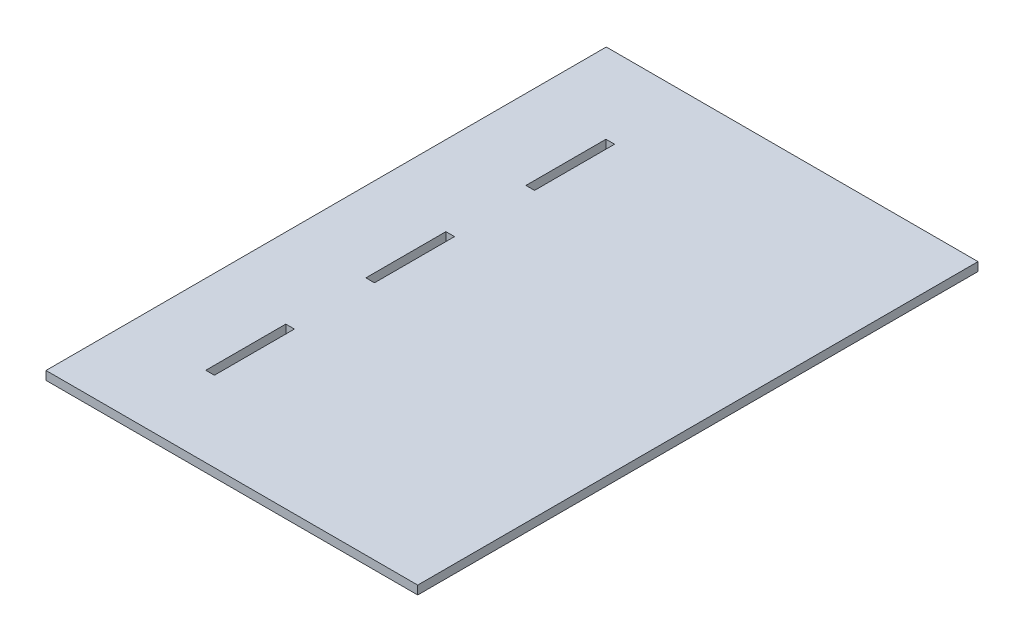
ISO-10303-21;
HEADER;
FILE_DESCRIPTION(('STEP AP214'),'2;1');
FILE_NAME('part.step','',(''),(''),'','','');
FILE_SCHEMA(('AUTOMOTIVE_DESIGN { 1 0 10303 214 1 1 1 1 }'));
ENDSEC;
DATA;
#1=APPLICATION_CONTEXT('core data for automotive mechanical design processes');
#2=APPLICATION_PROTOCOL_DEFINITION('international standard','automotive_design',2000,#1);
#3=PRODUCT_CONTEXT('',#1,'mechanical');
#4=PRODUCT('Part','Part','',(#3));
#5=PRODUCT_RELATED_PRODUCT_CATEGORY('part','',(#4));
#6=PRODUCT_DEFINITION_FORMATION('','',#4);
#7=PRODUCT_DEFINITION_CONTEXT('part definition',#1,'design');
#8=PRODUCT_DEFINITION('design','',#6,#7);
#9=PRODUCT_DEFINITION_SHAPE('','',#8);
#10=(LENGTH_UNIT() NAMED_UNIT(*) SI_UNIT(.MILLI.,.METRE.));
#11=(NAMED_UNIT(*) PLANE_ANGLE_UNIT() SI_UNIT($,.RADIAN.));
#12=(NAMED_UNIT(*) SI_UNIT($,.STERADIAN.) SOLID_ANGLE_UNIT());
#13=UNCERTAINTY_MEASURE_WITH_UNIT(LENGTH_MEASURE(1.E-05),#10,'distance_accuracy_value','');
#14=(GEOMETRIC_REPRESENTATION_CONTEXT(3) GLOBAL_UNCERTAINTY_ASSIGNED_CONTEXT((#13)) GLOBAL_UNIT_ASSIGNED_CONTEXT((#10,
#11,#12)) REPRESENTATION_CONTEXT('',''));
#15=CARTESIAN_POINT('',(0.,0.,0.));
#16=DIRECTION('',(0.,0.,1.));
#17=DIRECTION('',(1.,0.,0.));
#18=AXIS2_PLACEMENT_3D('',#15,#16,#17);
#19=CARTESIAN_POINT('',(93.9799999999998,10.16,0.));
#20=DIRECTION('',(1.,0.,0.));
#21=DIRECTION('',(0.,0.,-1.));
#22=AXIS2_PLACEMENT_3D('',#19,#20,#21);
#23=PLANE('',#22);
#24=DIRECTION('',(0.,0.,1.));
#25=VECTOR('',#24,1.);
#26=CARTESIAN_POINT('',(93.9799999999998,0.,0.));
#27=LINE('',#26,#25);
#28=CARTESIAN_POINT('',(93.9799999999998,0.,94.3428571428572));
#29=VERTEX_POINT('',#28);
#30=CARTESIAN_POINT('',(93.9799999999998,0.,188.685714285714));
#31=VERTEX_POINT('',#30);
#32=EDGE_CURVE('E250',#29,#31,#27,.T.);
#33=ORIENTED_EDGE('',*,*,#32,.F.);
#34=DIRECTION('',(0.,-1.,0.));
#35=VECTOR('',#34,1.);
#36=CARTESIAN_POINT('',(93.9799999999998,10.16,94.3428571428572));
#37=LINE('',#36,#35);
#38=CARTESIAN_POINT('',(93.9799999999998,10.16,94.3428571428572));
#39=VERTEX_POINT('',#38);
#40=EDGE_CURVE('E11',#39,#29,#37,.T.);
#41=ORIENTED_EDGE('',*,*,#40,.F.);
#42=DIRECTION('',(0.,0.,1.));
#43=VECTOR('',#42,1.);
#44=CARTESIAN_POINT('',(93.9799999999998,10.16,0.));
#45=LINE('',#44,#43);
#46=CARTESIAN_POINT('',(93.9799999999998,10.16,188.685714285714));
#47=VERTEX_POINT('',#46);
#48=EDGE_CURVE('E173',#39,#47,#45,.T.);
#49=ORIENTED_EDGE('',*,*,#48,.T.);
#50=DIRECTION('',(0.,-1.,0.));
#51=VECTOR('',#50,1.);
#52=CARTESIAN_POINT('',(93.9799999999998,10.16,188.685714285714));
#53=LINE('',#52,#51);
#54=EDGE_CURVE('E112',#47,#31,#53,.T.);
#55=ORIENTED_EDGE('',*,*,#54,.T.);
#56=EDGE_LOOP('',(#33,#41,#49,#55));
#57=FACE_BOUND('',#56,.T.);
#58=ADVANCED_FACE('F35',(#57),#23,.T.);
#59=CARTESIAN_POINT('',(0.,10.16,94.3428571428572));
#60=DIRECTION('',(0.,0.,-1.));
#61=DIRECTION('',(-1.,0.,0.));
#62=AXIS2_PLACEMENT_3D('',#59,#60,#61);
#63=PLANE('',#62);
#64=DIRECTION('',(1.,0.,0.));
#65=VECTOR('',#64,1.);
#66=CARTESIAN_POINT('',(0.,0.,94.3428571428572));
#67=LINE('',#66,#65);
#68=CARTESIAN_POINT('',(104.14,0.,94.3428571428572));
#69=VERTEX_POINT('',#68);
#70=EDGE_CURVE('E178',#29,#69,#67,.T.);
#71=ORIENTED_EDGE('',*,*,#70,.T.);
#72=DIRECTION('',(0.,-1.,0.));
#73=VECTOR('',#72,1.);
#74=CARTESIAN_POINT('',(104.14,10.16,94.3428571428572));
#75=LINE('',#74,#73);
#76=CARTESIAN_POINT('',(104.14,10.16,94.3428571428572));
#77=VERTEX_POINT('',#76);
#78=EDGE_CURVE('E45',#77,#69,#75,.T.);
#79=ORIENTED_EDGE('',*,*,#78,.F.);
#80=DIRECTION('',(1.,0.,0.));
#81=VECTOR('',#80,1.);
#82=CARTESIAN_POINT('',(0.,10.16,94.3428571428572));
#83=LINE('',#82,#81);
#84=EDGE_CURVE('E167',#39,#77,#83,.T.);
#85=ORIENTED_EDGE('',*,*,#84,.F.);
#86=ORIENTED_EDGE('',*,*,#40,.T.);
#87=EDGE_LOOP('',(#71,#79,#85,#86));
#88=FACE_BOUND('',#87,.T.);
#89=ADVANCED_FACE('F176',(#88),#63,.F.);
#90=CARTESIAN_POINT('',(104.14,10.16,0.));
#91=DIRECTION('',(1.,0.,0.));
#92=DIRECTION('',(0.,0.,-1.));
#93=AXIS2_PLACEMENT_3D('',#90,#91,#92);
#94=PLANE('',#93);
#95=DIRECTION('',(0.,0.,1.));
#96=VECTOR('',#95,1.);
#97=CARTESIAN_POINT('',(104.14,0.,0.));
#98=LINE('',#97,#96);
#99=CARTESIAN_POINT('',(104.14,0.,188.685714285714));
#100=VERTEX_POINT('',#99);
#101=EDGE_CURVE('E242',#69,#100,#98,.T.);
#102=ORIENTED_EDGE('',*,*,#101,.T.);
#103=DIRECTION('',(0.,-1.,0.));
#104=VECTOR('',#103,1.);
#105=CARTESIAN_POINT('',(104.14,10.16,188.685714285714));
#106=LINE('',#105,#104);
#107=CARTESIAN_POINT('',(104.14,10.16,188.685714285714));
#108=VERTEX_POINT('',#107);
#109=EDGE_CURVE('E166',#108,#100,#106,.T.);
#110=ORIENTED_EDGE('',*,*,#109,.F.);
#111=DIRECTION('',(0.,0.,1.));
#112=VECTOR('',#111,1.);
#113=CARTESIAN_POINT('',(104.14,10.16,0.));
#114=LINE('',#113,#112);
#115=EDGE_CURVE('E160',#77,#108,#114,.T.);
#116=ORIENTED_EDGE('',*,*,#115,.F.);
#117=ORIENTED_EDGE('',*,*,#78,.T.);
#118=EDGE_LOOP('',(#102,#110,#116,#117));
#119=FACE_BOUND('',#118,.T.);
#120=ADVANCED_FACE('F163',(#119),#94,.F.);
#121=CARTESIAN_POINT('',(0.,10.16,283.028571428571));
#122=DIRECTION('',(0.,0.,-1.));
#123=DIRECTION('',(-1.,0.,0.));
#124=AXIS2_PLACEMENT_3D('',#121,#122,#123);
#125=PLANE('',#124);
#126=DIRECTION('',(1.,0.,0.));
#127=VECTOR('',#126,1.);
#128=CARTESIAN_POINT('',(0.,0.,283.028571428571));
#129=LINE('',#128,#127);
#130=CARTESIAN_POINT('',(93.9799999999998,0.,283.028571428571));
#131=VERTEX_POINT('',#130);
#132=CARTESIAN_POINT('',(104.14,0.,283.028571428571));
#133=VERTEX_POINT('',#132);
#134=EDGE_CURVE('E249',#131,#133,#129,.T.);
#135=ORIENTED_EDGE('',*,*,#134,.T.);
#136=DIRECTION('',(0.,-1.,0.));
#137=VECTOR('',#136,1.);
#138=CARTESIAN_POINT('',(104.14,10.16,283.028571428571));
#139=LINE('',#138,#137);
#140=CARTESIAN_POINT('',(104.14,10.16,283.028571428571));
#141=VERTEX_POINT('',#140);
#142=EDGE_CURVE('E191',#141,#133,#139,.T.);
#143=ORIENTED_EDGE('',*,*,#142,.F.);
#144=DIRECTION('',(1.,0.,0.));
#145=VECTOR('',#144,1.);
#146=CARTESIAN_POINT('',(0.,10.16,283.028571428571));
#147=LINE('',#146,#145);
#148=CARTESIAN_POINT('',(93.9799999999998,10.16,283.028571428571));
#149=VERTEX_POINT('',#148);
#150=EDGE_CURVE('E282',#149,#141,#147,.T.);
#151=ORIENTED_EDGE('',*,*,#150,.F.);
#152=DIRECTION('',(0.,-1.,0.));
#153=VECTOR('',#152,1.);
#154=CARTESIAN_POINT('',(93.9799999999998,10.16,283.028571428571));
#155=LINE('',#154,#153);
#156=EDGE_CURVE('E183',#149,#131,#155,.T.);
#157=ORIENTED_EDGE('',*,*,#156,.T.);
#158=EDGE_LOOP('',(#135,#143,#151,#157));
#159=FACE_BOUND('',#158,.T.);
#160=ADVANCED_FACE('F346',(#159),#125,.F.);
#161=CARTESIAN_POINT('',(104.14,0.,377.371428571429));
#162=VERTEX_POINT('',#161);
#163=EDGE_CURVE('E243',#133,#162,#98,.T.);
#164=ORIENTED_EDGE('',*,*,#163,.T.);
#165=DIRECTION('',(0.,-1.,0.));
#166=VECTOR('',#165,1.);
#167=CARTESIAN_POINT('',(104.14,10.16,377.371428571429));
#168=LINE('',#167,#166);
#169=CARTESIAN_POINT('',(104.14,10.16,377.371428571429));
#170=VERTEX_POINT('',#169);
#171=EDGE_CURVE('E188',#170,#162,#168,.T.);
#172=ORIENTED_EDGE('',*,*,#171,.F.);
#173=EDGE_CURVE('E169',#141,#170,#114,.T.);
#174=ORIENTED_EDGE('',*,*,#173,.F.);
#175=ORIENTED_EDGE('',*,*,#142,.T.);
#176=EDGE_LOOP('',(#164,#172,#174,#175));
#177=FACE_BOUND('',#176,.T.);
#178=ADVANCED_FACE('F262',(#177),#94,.F.);
#179=CARTESIAN_POINT('',(0.,10.16,377.371428571429));
#180=DIRECTION('',(0.,0.,1.));
#181=DIRECTION('',(1.,0.,0.));
#182=AXIS2_PLACEMENT_3D('',#179,#180,#181);
#183=PLANE('',#182);
#184=DIRECTION('',(-1.,0.,0.));
#185=VECTOR('',#184,1.);
#186=CARTESIAN_POINT('',(0.,0.,377.371428571429));
#187=LINE('',#186,#185);
#188=CARTESIAN_POINT('',(93.9799999999999,0.,377.371428571429));
#189=VERTEX_POINT('',#188);
#190=EDGE_CURVE('E254',#162,#189,#187,.T.);
#191=ORIENTED_EDGE('',*,*,#190,.T.);
#192=DIRECTION('',(0.,-1.,0.));
#193=VECTOR('',#192,1.);
#194=CARTESIAN_POINT('',(93.9799999999999,10.16,377.371428571429));
#195=LINE('',#194,#193);
#196=CARTESIAN_POINT('',(93.9799999999999,10.16,377.371428571429));
#197=VERTEX_POINT('',#196);
#198=EDGE_CURVE('E185',#197,#189,#195,.T.);
#199=ORIENTED_EDGE('',*,*,#198,.F.);
#200=DIRECTION('',(-1.,0.,0.));
#201=VECTOR('',#200,1.);
#202=CARTESIAN_POINT('',(0.,10.16,377.371428571429));
#203=LINE('',#202,#201);
#204=EDGE_CURVE('E272',#170,#197,#203,.T.);
#205=ORIENTED_EDGE('',*,*,#204,.F.);
#206=ORIENTED_EDGE('',*,*,#171,.T.);
#207=EDGE_LOOP('',(#191,#199,#205,#206));
#208=FACE_BOUND('',#207,.T.);
#209=ADVANCED_FACE('F269',(#208),#183,.F.);
#210=CARTESIAN_POINT('',(0.,10.16,471.714285714286));
#211=DIRECTION('',(0.,0.,-1.));
#212=DIRECTION('',(-1.,0.,0.));
#213=AXIS2_PLACEMENT_3D('',#210,#211,#212);
#214=PLANE('',#213);
#215=DIRECTION('',(1.,0.,0.));
#216=VECTOR('',#215,1.);
#217=CARTESIAN_POINT('',(0.,0.,471.714285714286));
#218=LINE('',#217,#216);
#219=CARTESIAN_POINT('',(93.9799999999999,0.,471.714285714286));
#220=VERTEX_POINT('',#219);
#221=CARTESIAN_POINT('',(104.14,0.,471.714285714286));
#222=VERTEX_POINT('',#221);
#223=EDGE_CURVE('E236',#220,#222,#218,.T.);
#224=ORIENTED_EDGE('',*,*,#223,.T.);
#225=DIRECTION('',(0.,-1.,0.));
#226=VECTOR('',#225,1.);
#227=CARTESIAN_POINT('',(104.14,10.16,471.714285714286));
#228=LINE('',#227,#226);
#229=CARTESIAN_POINT('',(104.14,10.16,471.714285714286));
#230=VERTEX_POINT('',#229);
#231=EDGE_CURVE('E186',#230,#222,#228,.T.);
#232=ORIENTED_EDGE('',*,*,#231,.F.);
#233=DIRECTION('',(1.,0.,0.));
#234=VECTOR('',#233,1.);
#235=CARTESIAN_POINT('',(0.,10.16,471.714285714286));
#236=LINE('',#235,#234);
#237=CARTESIAN_POINT('',(93.9799999999999,10.16,471.714285714286));
#238=VERTEX_POINT('',#237);
#239=EDGE_CURVE('E290',#238,#230,#236,.T.);
#240=ORIENTED_EDGE('',*,*,#239,.F.);
#241=DIRECTION('',(0.,-1.,0.));
#242=VECTOR('',#241,1.);
#243=CARTESIAN_POINT('',(93.9799999999999,10.16,471.714285714286));
#244=LINE('',#243,#242);
#245=EDGE_CURVE('E194',#238,#220,#244,.T.);
#246=ORIENTED_EDGE('',*,*,#245,.T.);
#247=EDGE_LOOP('',(#224,#232,#240,#246));
#248=FACE_BOUND('',#247,.T.);
#249=ADVANCED_FACE('F342',(#248),#214,.F.);
#250=CARTESIAN_POINT('',(104.14,0.,566.057142857143));
#251=VERTEX_POINT('',#250);
#252=EDGE_CURVE('E239',#222,#251,#98,.T.);
#253=ORIENTED_EDGE('',*,*,#252,.T.);
#254=DIRECTION('',(0.,-1.,0.));
#255=VECTOR('',#254,1.);
#256=CARTESIAN_POINT('',(104.14,10.16,566.057142857143));
#257=LINE('',#256,#255);
#258=CARTESIAN_POINT('',(104.14,10.16,566.057142857143));
#259=VERTEX_POINT('',#258);
#260=EDGE_CURVE('E198',#259,#251,#257,.T.);
#261=ORIENTED_EDGE('',*,*,#260,.F.);
#262=EDGE_CURVE('E170',#230,#259,#114,.T.);
#263=ORIENTED_EDGE('',*,*,#262,.F.);
#264=ORIENTED_EDGE('',*,*,#231,.T.);
#265=EDGE_LOOP('',(#253,#261,#263,#264));
#266=FACE_BOUND('',#265,.T.);
#267=ADVANCED_FACE('F336',(#266),#94,.F.);
#268=CARTESIAN_POINT('',(0.,10.16,566.057142857143));
#269=DIRECTION('',(0.,0.,1.));
#270=DIRECTION('',(1.,0.,0.));
#271=AXIS2_PLACEMENT_3D('',#268,#269,#270);
#272=PLANE('',#271);
#273=DIRECTION('',(-1.,0.,0.));
#274=VECTOR('',#273,1.);
#275=CARTESIAN_POINT('',(0.,0.,566.057142857143));
#276=LINE('',#275,#274);
#277=CARTESIAN_POINT('',(93.9799999999999,0.,566.057142857143));
#278=VERTEX_POINT('',#277);
#279=EDGE_CURVE('E241',#251,#278,#276,.T.);
#280=ORIENTED_EDGE('',*,*,#279,.T.);
#281=DIRECTION('',(0.,-1.,0.));
#282=VECTOR('',#281,1.);
#283=CARTESIAN_POINT('',(93.9799999999999,10.16,566.057142857143));
#284=LINE('',#283,#282);
#285=CARTESIAN_POINT('',(93.9799999999999,10.16,566.057142857143));
#286=VERTEX_POINT('',#285);
#287=EDGE_CURVE('E196',#286,#278,#284,.T.);
#288=ORIENTED_EDGE('',*,*,#287,.F.);
#289=DIRECTION('',(-1.,0.,0.));
#290=VECTOR('',#289,1.);
#291=CARTESIAN_POINT('',(0.,10.16,566.057142857143));
#292=LINE('',#291,#290);
#293=EDGE_CURVE('E283',#259,#286,#292,.T.);
#294=ORIENTED_EDGE('',*,*,#293,.F.);
#295=ORIENTED_EDGE('',*,*,#260,.T.);
#296=EDGE_LOOP('',(#280,#288,#294,#295));
#297=FACE_BOUND('',#296,.T.);
#298=ADVANCED_FACE('F332',(#297),#272,.F.);
#299=CARTESIAN_POINT('',(0.,10.16,660.4));
#300=DIRECTION('',(0.,0.,-1.));
#301=DIRECTION('',(-1.,0.,0.));
#302=AXIS2_PLACEMENT_3D('',#299,#300,#301);
#303=PLANE('',#302);
#304=DIRECTION('',(1.,0.,0.));
#305=VECTOR('',#304,1.);
#306=CARTESIAN_POINT('',(0.,0.,660.4));
#307=LINE('',#306,#305);
#308=CARTESIAN_POINT('',(0.,0.,660.4));
#309=VERTEX_POINT('',#308);
#310=CARTESIAN_POINT('',(438.15,0.,660.4));
#311=VERTEX_POINT('',#310);
#312=EDGE_CURVE('E222',#309,#311,#307,.T.);
#313=ORIENTED_EDGE('',*,*,#312,.T.);
#314=DIRECTION('',(0.,-1.,0.));
#315=VECTOR('',#314,1.);
#316=CARTESIAN_POINT('',(438.15,10.16,660.4));
#317=LINE('',#316,#315);
#318=CARTESIAN_POINT('',(438.15,10.16,660.4));
#319=VERTEX_POINT('',#318);
#320=EDGE_CURVE('E39',#319,#311,#317,.T.);
#321=ORIENTED_EDGE('',*,*,#320,.F.);
#322=DIRECTION('',(1.,0.,0.));
#323=VECTOR('',#322,1.);
#324=CARTESIAN_POINT('',(0.,10.16,660.4));
#325=LINE('',#324,#323);
#326=CARTESIAN_POINT('',(0.,10.16,660.4));
#327=VERTEX_POINT('',#326);
#328=EDGE_CURVE('E120',#327,#319,#325,.T.);
#329=ORIENTED_EDGE('',*,*,#328,.F.);
#330=DIRECTION('',(0.,-1.,0.));
#331=VECTOR('',#330,1.);
#332=CARTESIAN_POINT('',(0.,10.16,660.4));
#333=LINE('',#332,#331);
#334=EDGE_CURVE('E203',#327,#309,#333,.T.);
#335=ORIENTED_EDGE('',*,*,#334,.T.);
#336=EDGE_LOOP('',(#313,#321,#329,#335));
#337=FACE_BOUND('',#336,.T.);
#338=ADVANCED_FACE('F37',(#337),#303,.F.);
#339=CARTESIAN_POINT('',(438.15,10.16,0.));
#340=DIRECTION('',(1.,0.,0.));
#341=DIRECTION('',(0.,0.,-1.));
#342=AXIS2_PLACEMENT_3D('',#339,#340,#341);
#343=PLANE('',#342);
#344=DIRECTION('',(0.,0.,1.));
#345=VECTOR('',#344,1.);
#346=CARTESIAN_POINT('',(438.15,0.,0.));
#347=LINE('',#346,#345);
#348=CARTESIAN_POINT('',(438.15,0.,0.));
#349=VERTEX_POINT('',#348);
#350=EDGE_CURVE('E217',#349,#311,#347,.T.);
#351=ORIENTED_EDGE('',*,*,#350,.F.);
#352=DIRECTION('',(0.,-1.,0.));
#353=VECTOR('',#352,1.);
#354=CARTESIAN_POINT('',(438.15,10.16,0.));
#355=LINE('',#354,#353);
#356=CARTESIAN_POINT('',(438.15,10.16,0.));
#357=VERTEX_POINT('',#356);
#358=EDGE_CURVE('E207',#357,#349,#355,.T.);
#359=ORIENTED_EDGE('',*,*,#358,.F.);
#360=DIRECTION('',(0.,0.,1.));
#361=VECTOR('',#360,1.);
#362=CARTESIAN_POINT('',(438.15,10.16,0.));
#363=LINE('',#362,#361);
#364=EDGE_CURVE('E219',#357,#319,#363,.T.);
#365=ORIENTED_EDGE('',*,*,#364,.T.);
#366=ORIENTED_EDGE('',*,*,#320,.T.);
#367=EDGE_LOOP('',(#351,#359,#365,#366));
#368=FACE_BOUND('',#367,.T.);
#369=ADVANCED_FACE('F215',(#368),#343,.T.);
#370=CARTESIAN_POINT('',(0.,10.16,0.));
#371=DIRECTION('',(0.,0.,-1.));
#372=DIRECTION('',(-1.,0.,0.));
#373=AXIS2_PLACEMENT_3D('',#370,#371,#372);
#374=PLANE('',#373);
#375=DIRECTION('',(1.,0.,0.));
#376=VECTOR('',#375,1.);
#377=CARTESIAN_POINT('',(0.,0.,0.));
#378=LINE('',#377,#376);
#379=CARTESIAN_POINT('',(0.,0.,0.));
#380=VERTEX_POINT('',#379);
#381=EDGE_CURVE('E229',#380,#349,#378,.T.);
#382=ORIENTED_EDGE('',*,*,#381,.F.);
#383=DIRECTION('',(0.,-1.,0.));
#384=VECTOR('',#383,1.);
#385=CARTESIAN_POINT('',(0.,10.16,0.));
#386=LINE('',#385,#384);
#387=CARTESIAN_POINT('',(0.,10.16,0.));
#388=VERTEX_POINT('',#387);
#389=EDGE_CURVE('E206',#388,#380,#386,.T.);
#390=ORIENTED_EDGE('',*,*,#389,.F.);
#391=DIRECTION('',(1.,0.,0.));
#392=VECTOR('',#391,1.);
#393=CARTESIAN_POINT('',(0.,10.16,0.));
#394=LINE('',#393,#392);
#395=EDGE_CURVE('E296',#388,#357,#394,.T.);
#396=ORIENTED_EDGE('',*,*,#395,.T.);
#397=ORIENTED_EDGE('',*,*,#358,.T.);
#398=EDGE_LOOP('',(#382,#390,#396,#397));
#399=FACE_BOUND('',#398,.T.);
#400=ADVANCED_FACE('F299',(#399),#374,.T.);
#401=EDGE_CURVE('E251',#131,#189,#27,.T.);
#402=ORIENTED_EDGE('',*,*,#401,.F.);
#403=ORIENTED_EDGE('',*,*,#156,.F.);
#404=EDGE_CURVE('E275',#149,#197,#45,.T.);
#405=ORIENTED_EDGE('',*,*,#404,.T.);
#406=ORIENTED_EDGE('',*,*,#198,.T.);
#407=EDGE_LOOP('',(#402,#403,#405,#406));
#408=FACE_BOUND('',#407,.T.);
#409=ADVANCED_FACE('F312',(#408),#23,.T.);
#410=EDGE_CURVE('E246',#220,#278,#27,.T.);
#411=ORIENTED_EDGE('',*,*,#410,.F.);
#412=ORIENTED_EDGE('',*,*,#245,.F.);
#413=EDGE_CURVE('E277',#238,#286,#45,.T.);
#414=ORIENTED_EDGE('',*,*,#413,.T.);
#415=ORIENTED_EDGE('',*,*,#287,.T.);
#416=EDGE_LOOP('',(#411,#412,#414,#415));
#417=FACE_BOUND('',#416,.T.);
#418=ADVANCED_FACE('F305',(#417),#23,.T.);
#419=CARTESIAN_POINT('',(0.,10.16,0.));
#420=DIRECTION('',(1.,0.,0.));
#421=DIRECTION('',(0.,0.,-1.));
#422=AXIS2_PLACEMENT_3D('',#419,#420,#421);
#423=PLANE('',#422);
#424=DIRECTION('',(0.,0.,1.));
#425=VECTOR('',#424,1.);
#426=CARTESIAN_POINT('',(0.,0.,0.));
#427=LINE('',#426,#425);
#428=EDGE_CURVE('E231',#380,#309,#427,.T.);
#429=ORIENTED_EDGE('',*,*,#428,.T.);
#430=ORIENTED_EDGE('',*,*,#334,.F.);
#431=DIRECTION('',(0.,0.,1.));
#432=VECTOR('',#431,1.);
#433=CARTESIAN_POINT('',(0.,10.16,0.));
#434=LINE('',#433,#432);
#435=EDGE_CURVE('E294',#388,#327,#434,.T.);
#436=ORIENTED_EDGE('',*,*,#435,.F.);
#437=ORIENTED_EDGE('',*,*,#389,.T.);
#438=EDGE_LOOP('',(#429,#430,#436,#437));
#439=FACE_BOUND('',#438,.T.);
#440=ADVANCED_FACE('F302',(#439),#423,.F.);
#441=CARTESIAN_POINT('',(0.,10.16,188.685714285714));
#442=DIRECTION('',(0.,0.,1.));
#443=DIRECTION('',(1.,0.,0.));
#444=AXIS2_PLACEMENT_3D('',#441,#442,#443);
#445=PLANE('',#444);
#446=DIRECTION('',(-1.,0.,0.));
#447=VECTOR('',#446,1.);
#448=CARTESIAN_POINT('',(0.,0.,188.685714285714));
#449=LINE('',#448,#447);
#450=EDGE_CURVE('E105',#100,#31,#449,.T.);
#451=ORIENTED_EDGE('',*,*,#450,.T.);
#452=ORIENTED_EDGE('',*,*,#54,.F.);
#453=DIRECTION('',(-1.,0.,0.));
#454=VECTOR('',#453,1.);
#455=CARTESIAN_POINT('',(0.,10.16,188.685714285714));
#456=LINE('',#455,#454);
#457=EDGE_CURVE('E54',#108,#47,#456,.T.);
#458=ORIENTED_EDGE('',*,*,#457,.F.);
#459=ORIENTED_EDGE('',*,*,#109,.T.);
#460=EDGE_LOOP('',(#451,#452,#458,#459));
#461=FACE_BOUND('',#460,.T.);
#462=ADVANCED_FACE('F304',(#461),#445,.F.);
#463=CARTESIAN_POINT('',(0.,10.16,0.));
#464=DIRECTION('',(0.,1.,0.));
#465=DIRECTION('',(0.,0.,1.));
#466=AXIS2_PLACEMENT_3D('',#463,#464,#465);
#467=PLANE('',#466);
#468=ORIENTED_EDGE('',*,*,#328,.T.);
#469=ORIENTED_EDGE('',*,*,#364,.F.);
#470=ORIENTED_EDGE('',*,*,#395,.F.);
#471=ORIENTED_EDGE('',*,*,#435,.T.);
#472=EDGE_LOOP('',(#468,#469,#470,#471));
#473=FACE_BOUND('',#472,.T.);
#474=ORIENTED_EDGE('',*,*,#239,.T.);
#475=ORIENTED_EDGE('',*,*,#262,.T.);
#476=ORIENTED_EDGE('',*,*,#293,.T.);
#477=ORIENTED_EDGE('',*,*,#413,.F.);
#478=EDGE_LOOP('',(#474,#475,#476,#477));
#479=FACE_BOUND('',#478,.T.);
#480=ORIENTED_EDGE('',*,*,#150,.T.);
#481=ORIENTED_EDGE('',*,*,#173,.T.);
#482=ORIENTED_EDGE('',*,*,#204,.T.);
#483=ORIENTED_EDGE('',*,*,#404,.F.);
#484=EDGE_LOOP('',(#480,#481,#482,#483));
#485=FACE_BOUND('',#484,.T.);
#486=ORIENTED_EDGE('',*,*,#48,.F.);
#487=ORIENTED_EDGE('',*,*,#84,.T.);
#488=ORIENTED_EDGE('',*,*,#115,.T.);
#489=ORIENTED_EDGE('',*,*,#457,.T.);
#490=EDGE_LOOP('',(#486,#487,#488,#489));
#491=FACE_BOUND('',#490,.T.);
#492=ADVANCED_FACE('F172',(#473,#479,#485,#491),#467,.T.);
#493=CARTESIAN_POINT('',(0.,0.,0.));
#494=DIRECTION('',(0.,1.,0.));
#495=DIRECTION('',(0.,0.,1.));
#496=AXIS2_PLACEMENT_3D('',#493,#494,#495);
#497=PLANE('',#496);
#498=ORIENTED_EDGE('',*,*,#312,.F.);
#499=ORIENTED_EDGE('',*,*,#428,.F.);
#500=ORIENTED_EDGE('',*,*,#381,.T.);
#501=ORIENTED_EDGE('',*,*,#350,.T.);
#502=EDGE_LOOP('',(#498,#499,#500,#501));
#503=FACE_BOUND('',#502,.T.);
#504=ORIENTED_EDGE('',*,*,#223,.F.);
#505=ORIENTED_EDGE('',*,*,#410,.T.);
#506=ORIENTED_EDGE('',*,*,#279,.F.);
#507=ORIENTED_EDGE('',*,*,#252,.F.);
#508=EDGE_LOOP('',(#504,#505,#506,#507));
#509=FACE_BOUND('',#508,.T.);
#510=ORIENTED_EDGE('',*,*,#134,.F.);
#511=ORIENTED_EDGE('',*,*,#401,.T.);
#512=ORIENTED_EDGE('',*,*,#190,.F.);
#513=ORIENTED_EDGE('',*,*,#163,.F.);
#514=EDGE_LOOP('',(#510,#511,#512,#513));
#515=FACE_BOUND('',#514,.T.);
#516=ORIENTED_EDGE('',*,*,#32,.T.);
#517=ORIENTED_EDGE('',*,*,#450,.F.);
#518=ORIENTED_EDGE('',*,*,#101,.F.);
#519=ORIENTED_EDGE('',*,*,#70,.F.);
#520=EDGE_LOOP('',(#516,#517,#518,#519));
#521=FACE_BOUND('',#520,.T.);
#522=ADVANCED_FACE('F227',(#503,#509,#515,#521),#497,.F.);
#523=CLOSED_SHELL('',(#58,#89,#120,#160,#178,#209,#249,#267,#298,#338,#369,#400,#409,#418,#440,
#462,#492,#522));
#524=MANIFOLD_SOLID_BREP('B2',#523);
#525=ADVANCED_BREP_SHAPE_REPRESENTATION('',(#18,#524),#14);
#526=SHAPE_DEFINITION_REPRESENTATION(#9,#525);
ENDSEC;
END-ISO-10303-21;
